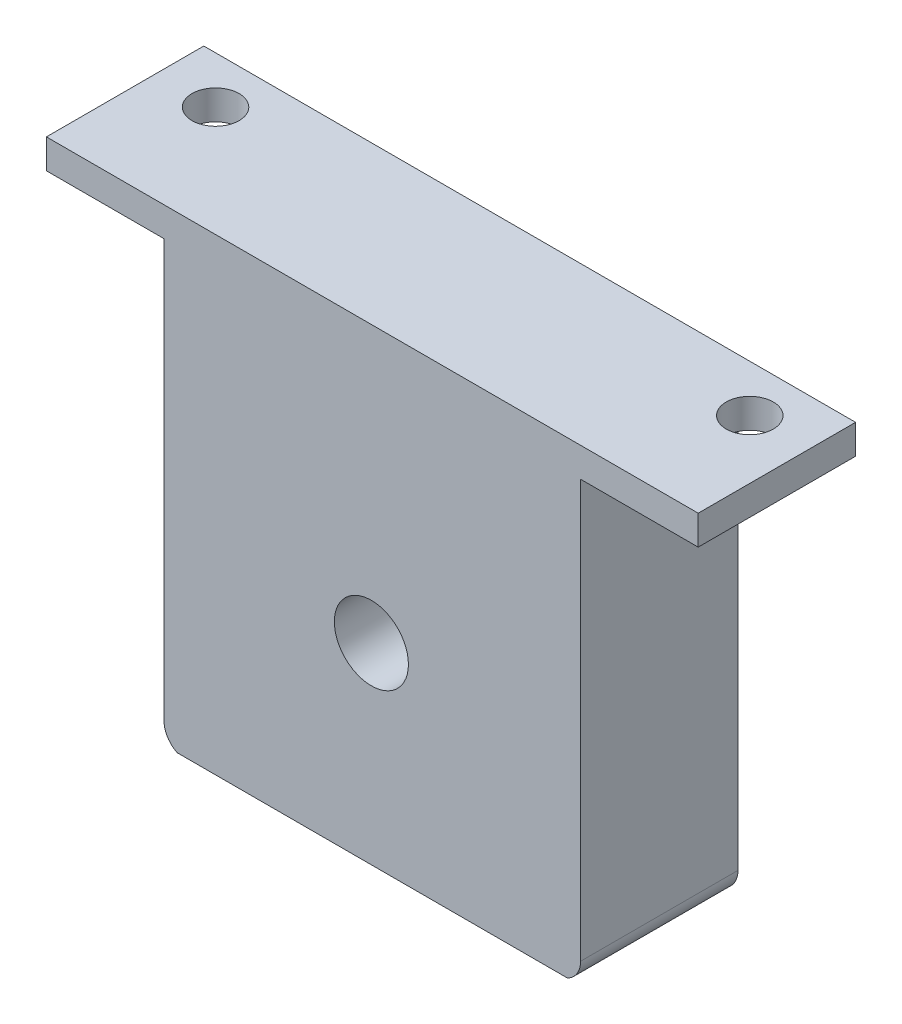
ISO-10303-21;
HEADER;
FILE_DESCRIPTION(('STEP AP214'),'2;1');
FILE_NAME('part.step','',(''),(''),'','','');
FILE_SCHEMA(('AUTOMOTIVE_DESIGN { 1 0 10303 214 1 1 1 1 }'));
ENDSEC;
DATA;
#1=APPLICATION_CONTEXT('core data for automotive mechanical design processes');
#2=APPLICATION_PROTOCOL_DEFINITION('international standard','automotive_design',2000,#1);
#3=PRODUCT_CONTEXT('',#1,'mechanical');
#4=PRODUCT('Part','Part','',(#3));
#5=PRODUCT_RELATED_PRODUCT_CATEGORY('part','',(#4));
#6=PRODUCT_DEFINITION_FORMATION('','',#4);
#7=PRODUCT_DEFINITION_CONTEXT('part definition',#1,'design');
#8=PRODUCT_DEFINITION('design','',#6,#7);
#9=PRODUCT_DEFINITION_SHAPE('','',#8);
#10=(LENGTH_UNIT() NAMED_UNIT(*) SI_UNIT(.MILLI.,.METRE.));
#11=(NAMED_UNIT(*) PLANE_ANGLE_UNIT() SI_UNIT($,.RADIAN.));
#12=(NAMED_UNIT(*) SI_UNIT($,.STERADIAN.) SOLID_ANGLE_UNIT());
#13=UNCERTAINTY_MEASURE_WITH_UNIT(LENGTH_MEASURE(1.E-05),#10,'distance_accuracy_value','');
#14=(GEOMETRIC_REPRESENTATION_CONTEXT(3) GLOBAL_UNCERTAINTY_ASSIGNED_CONTEXT((#13)) GLOBAL_UNIT_ASSIGNED_CONTEXT((#10,
#11,#12)) REPRESENTATION_CONTEXT('',''));
#15=CARTESIAN_POINT('',(0.,0.,0.));
#16=DIRECTION('',(0.,0.,1.));
#17=DIRECTION('',(1.,0.,0.));
#18=AXIS2_PLACEMENT_3D('',#15,#16,#17);
#19=CARTESIAN_POINT('',(45.,0.,17.));
#20=DIRECTION('',(-1.,0.,0.));
#21=DIRECTION('',(0.,0.,1.));
#22=AXIS2_PLACEMENT_3D('',#19,#20,#21);
#23=PLANE('',#22);
#24=DIRECTION('',(0.,0.,1.));
#25=VECTOR('',#24,1.);
#26=CARTESIAN_POINT('',(45.,47.625,0.));
#27=LINE('',#26,#25);
#28=CARTESIAN_POINT('',(45.,47.625,0.));
#29=VERTEX_POINT('',#28);
#30=CARTESIAN_POINT('',(45.,47.625,17.));
#31=VERTEX_POINT('',#30);
#32=EDGE_CURVE('E165',#29,#31,#27,.T.);
#33=ORIENTED_EDGE('',*,*,#32,.T.);
#34=DIRECTION('',(0.,1.,0.));
#35=VECTOR('',#34,1.);
#36=CARTESIAN_POINT('',(45.,0.,17.));
#37=LINE('',#36,#35);
#38=CARTESIAN_POINT('',(45.,2.54,17.));
#39=VERTEX_POINT('',#38);
#40=EDGE_CURVE('E212',#39,#31,#37,.T.);
#41=ORIENTED_EDGE('',*,*,#40,.F.);
#42=DIRECTION('',(0.,0.,-1.));
#43=VECTOR('',#42,1.);
#44=CARTESIAN_POINT('',(45.,2.54,17.));
#45=LINE('',#44,#43);
#46=CARTESIAN_POINT('',(45.,2.54,0.));
#47=VERTEX_POINT('',#46);
#48=EDGE_CURVE('E50',#39,#47,#45,.T.);
#49=ORIENTED_EDGE('',*,*,#48,.T.);
#50=DIRECTION('',(0.,1.,0.));
#51=VECTOR('',#50,1.);
#52=CARTESIAN_POINT('',(45.,0.,0.));
#53=LINE('',#52,#51);
#54=EDGE_CURVE('E223',#47,#29,#53,.T.);
#55=ORIENTED_EDGE('',*,*,#54,.T.);
#56=EDGE_LOOP('',(#33,#41,#49,#55));
#57=FACE_BOUND('',#56,.T.);
#58=ADVANCED_FACE('F41',(#57),#23,.F.);
#59=CARTESIAN_POINT('',(0.,0.,17.));
#60=DIRECTION('',(0.,0.,-1.));
#61=DIRECTION('',(-1.,0.,0.));
#62=AXIS2_PLACEMENT_3D('',#59,#60,#61);
#63=PLANE('',#62);
#64=CARTESIAN_POINT('',(2.54,2.54,17.));
#65=DIRECTION('',(0.,0.,-1.));
#66=DIRECTION('',(-1.,0.,0.));
#67=AXIS2_PLACEMENT_3D('',#64,#65,#66);
#68=CIRCLE('',#67,2.54);
#69=CARTESIAN_POINT('',(0.,2.54,17.));
#70=VERTEX_POINT('',#69);
#71=CARTESIAN_POINT('',(1.43283966834067,0.253999999999998,17.));
#72=VERTEX_POINT('',#71);
#73=EDGE_CURVE('E241',#70,#72,#68,.F.);
#74=ORIENTED_EDGE('',*,*,#73,.T.);
#75=DIRECTION('',(1.,0.,0.));
#76=VECTOR('',#75,1.);
#77=CARTESIAN_POINT('',(0.,0.253999999999998,17.));
#78=LINE('',#77,#76);
#79=CARTESIAN_POINT('',(43.5671603316593,0.253999999999998,17.));
#80=VERTEX_POINT('',#79);
#81=EDGE_CURVE('E193',#72,#80,#78,.T.);
#82=ORIENTED_EDGE('',*,*,#81,.T.);
#83=CARTESIAN_POINT('',(42.46,2.54,17.));
#84=DIRECTION('',(0.,0.,-1.));
#85=DIRECTION('',(-1.,0.,0.));
#86=AXIS2_PLACEMENT_3D('',#83,#84,#85);
#87=CIRCLE('',#86,2.54);
#88=EDGE_CURVE('E238',#80,#39,#87,.F.);
#89=ORIENTED_EDGE('',*,*,#88,.T.);
#90=ORIENTED_EDGE('',*,*,#40,.T.);
#91=DIRECTION('',(1.,0.,0.));
#92=VECTOR('',#91,1.);
#93=CARTESIAN_POINT('',(45.,47.625,17.));
#94=LINE('',#93,#92);
#95=CARTESIAN_POINT('',(57.7,47.625,17.));
#96=VERTEX_POINT('',#95);
#97=EDGE_CURVE('E169',#31,#96,#94,.T.);
#98=ORIENTED_EDGE('',*,*,#97,.T.);
#99=DIRECTION('',(0.,1.,0.));
#100=VECTOR('',#99,1.);
#101=CARTESIAN_POINT('',(57.7,47.625,17.));
#102=LINE('',#101,#100);
#103=CARTESIAN_POINT('',(57.7,50.8,17.));
#104=VERTEX_POINT('',#103);
#105=EDGE_CURVE('E181',#96,#104,#102,.T.);
#106=ORIENTED_EDGE('',*,*,#105,.T.);
#107=DIRECTION('',(-1.,0.,0.));
#108=VECTOR('',#107,1.);
#109=CARTESIAN_POINT('',(0.,50.8,17.));
#110=LINE('',#109,#108);
#111=CARTESIAN_POINT('',(-12.7,50.8,17.));
#112=VERTEX_POINT('',#111);
#113=EDGE_CURVE('E217',#104,#112,#110,.T.);
#114=ORIENTED_EDGE('',*,*,#113,.T.);
#115=DIRECTION('',(0.,1.,0.));
#116=VECTOR('',#115,1.);
#117=CARTESIAN_POINT('',(-12.7,47.625,17.));
#118=LINE('',#117,#116);
#119=CARTESIAN_POINT('',(-12.7,47.625,17.));
#120=VERTEX_POINT('',#119);
#121=EDGE_CURVE('E128',#120,#112,#118,.T.);
#122=ORIENTED_EDGE('',*,*,#121,.F.);
#123=DIRECTION('',(1.,0.,0.));
#124=VECTOR('',#123,1.);
#125=CARTESIAN_POINT('',(0.,47.625,17.));
#126=LINE('',#125,#124);
#127=CARTESIAN_POINT('',(0.,47.625,17.));
#128=VERTEX_POINT('',#127);
#129=EDGE_CURVE('E129',#120,#128,#126,.T.);
#130=ORIENTED_EDGE('',*,*,#129,.T.);
#131=DIRECTION('',(0.,-1.,0.));
#132=VECTOR('',#131,1.);
#133=CARTESIAN_POINT('',(0.,0.,17.));
#134=LINE('',#133,#132);
#135=EDGE_CURVE('E57',#128,#70,#134,.T.);
#136=ORIENTED_EDGE('',*,*,#135,.T.);
#137=EDGE_LOOP('',(#74,#82,#89,#90,#98,#106,#114,#122,#130,#136));
#138=FACE_BOUND('',#137,.T.);
#139=CARTESIAN_POINT('',(22.4,21.,17.));
#140=DIRECTION('',(0.,0.,1.));
#141=DIRECTION('',(1.,0.,0.));
#142=AXIS2_PLACEMENT_3D('',#139,#140,#141);
#143=CIRCLE('',#142,4.);
#144=CARTESIAN_POINT('',(26.4,21.,17.));
#145=VERTEX_POINT('',#144);
#146=EDGE_CURVE('E203',#145,#145,#143,.T.);
#147=ORIENTED_EDGE('',*,*,#146,.F.);
#148=EDGE_LOOP('',(#147));
#149=FACE_BOUND('',#148,.T.);
#150=ADVANCED_FACE('F257',(#138,#149),#63,.F.);
#151=CARTESIAN_POINT('',(0.,0.,0.));
#152=DIRECTION('',(0.,0.,-1.));
#153=DIRECTION('',(-1.,0.,0.));
#154=AXIS2_PLACEMENT_3D('',#151,#152,#153);
#155=PLANE('',#154);
#156=DIRECTION('',(1.,0.,0.));
#157=VECTOR('',#156,1.);
#158=CARTESIAN_POINT('',(0.,0.254,0.));
#159=LINE('',#158,#157);
#160=CARTESIAN_POINT('',(1.43283966834067,0.254,0.));
#161=VERTEX_POINT('',#160);
#162=CARTESIAN_POINT('',(43.5671603316593,0.253999999999999,0.));
#163=VERTEX_POINT('',#162);
#164=EDGE_CURVE('E189',#161,#163,#159,.T.);
#165=ORIENTED_EDGE('',*,*,#164,.F.);
#166=CARTESIAN_POINT('',(2.54,2.54,0.));
#167=DIRECTION('',(0.,0.,-1.));
#168=DIRECTION('',(-1.,0.,0.));
#169=AXIS2_PLACEMENT_3D('',#166,#167,#168);
#170=CIRCLE('',#169,2.54);
#171=CARTESIAN_POINT('',(0.,2.54,0.));
#172=VERTEX_POINT('',#171);
#173=EDGE_CURVE('E232',#161,#172,#170,.T.);
#174=ORIENTED_EDGE('',*,*,#173,.T.);
#175=DIRECTION('',(0.,-1.,0.));
#176=VECTOR('',#175,1.);
#177=CARTESIAN_POINT('',(0.,0.,0.));
#178=LINE('',#177,#176);
#179=CARTESIAN_POINT('',(0.,47.625,0.));
#180=VERTEX_POINT('',#179);
#181=EDGE_CURVE('E142',#180,#172,#178,.T.);
#182=ORIENTED_EDGE('',*,*,#181,.F.);
#183=DIRECTION('',(-1.,0.,0.));
#184=VECTOR('',#183,1.);
#185=CARTESIAN_POINT('',(0.,47.625,0.));
#186=LINE('',#185,#184);
#187=CARTESIAN_POINT('',(-12.7,47.625,0.));
#188=VERTEX_POINT('',#187);
#189=EDGE_CURVE('E134',#180,#188,#186,.T.);
#190=ORIENTED_EDGE('',*,*,#189,.T.);
#191=DIRECTION('',(0.,1.,0.));
#192=VECTOR('',#191,1.);
#193=CARTESIAN_POINT('',(-12.7,47.625,0.));
#194=LINE('',#193,#192);
#195=CARTESIAN_POINT('',(-12.7,50.8,0.));
#196=VERTEX_POINT('',#195);
#197=EDGE_CURVE('E117',#188,#196,#194,.T.);
#198=ORIENTED_EDGE('',*,*,#197,.T.);
#199=DIRECTION('',(-1.,0.,0.));
#200=VECTOR('',#199,1.);
#201=CARTESIAN_POINT('',(0.,50.8,0.));
#202=LINE('',#201,#200);
#203=CARTESIAN_POINT('',(57.7,50.8,0.));
#204=VERTEX_POINT('',#203);
#205=EDGE_CURVE('E213',#204,#196,#202,.T.);
#206=ORIENTED_EDGE('',*,*,#205,.F.);
#207=DIRECTION('',(0.,1.,0.));
#208=VECTOR('',#207,1.);
#209=CARTESIAN_POINT('',(57.7,47.625,0.));
#210=LINE('',#209,#208);
#211=CARTESIAN_POINT('',(57.7,47.625,0.));
#212=VERTEX_POINT('',#211);
#213=EDGE_CURVE('E185',#212,#204,#210,.T.);
#214=ORIENTED_EDGE('',*,*,#213,.F.);
#215=DIRECTION('',(-1.,0.,0.));
#216=VECTOR('',#215,1.);
#217=CARTESIAN_POINT('',(45.,47.625,0.));
#218=LINE('',#217,#216);
#219=EDGE_CURVE('E177',#212,#29,#218,.T.);
#220=ORIENTED_EDGE('',*,*,#219,.T.);
#221=ORIENTED_EDGE('',*,*,#54,.F.);
#222=CARTESIAN_POINT('',(42.46,2.54,0.));
#223=DIRECTION('',(0.,0.,-1.));
#224=DIRECTION('',(-1.,0.,0.));
#225=AXIS2_PLACEMENT_3D('',#222,#223,#224);
#226=CIRCLE('',#225,2.54);
#227=EDGE_CURVE('E220',#47,#163,#226,.T.);
#228=ORIENTED_EDGE('',*,*,#227,.T.);
#229=EDGE_LOOP('',(#165,#174,#182,#190,#198,#206,#214,#220,#221,#228));
#230=FACE_BOUND('',#229,.T.);
#231=CARTESIAN_POINT('',(22.4,21.,0.));
#232=DIRECTION('',(0.,0.,1.));
#233=DIRECTION('',(1.,0.,0.));
#234=AXIS2_PLACEMENT_3D('',#231,#232,#233);
#235=CIRCLE('',#234,4.);
#236=CARTESIAN_POINT('',(26.4,21.,0.));
#237=VERTEX_POINT('',#236);
#238=EDGE_CURVE('E202',#237,#237,#235,.T.);
#239=ORIENTED_EDGE('',*,*,#238,.T.);
#240=EDGE_LOOP('',(#239));
#241=FACE_BOUND('',#240,.T.);
#242=ADVANCED_FACE('F139',(#230,#241),#155,.T.);
#243=CARTESIAN_POINT('',(0.,0.,17.));
#244=DIRECTION('',(1.,0.,0.));
#245=DIRECTION('',(0.,0.,-1.));
#246=AXIS2_PLACEMENT_3D('',#243,#244,#245);
#247=PLANE('',#246);
#248=ORIENTED_EDGE('',*,*,#135,.F.);
#249=DIRECTION('',(0.,0.,-1.));
#250=VECTOR('',#249,1.);
#251=CARTESIAN_POINT('',(0.,47.625,0.));
#252=LINE('',#251,#250);
#253=EDGE_CURVE('E61',#128,#180,#252,.T.);
#254=ORIENTED_EDGE('',*,*,#253,.T.);
#255=ORIENTED_EDGE('',*,*,#181,.T.);
#256=DIRECTION('',(0.,0.,-1.));
#257=VECTOR('',#256,1.);
#258=CARTESIAN_POINT('',(0.,2.54,17.));
#259=LINE('',#258,#257);
#260=EDGE_CURVE('E235',#172,#70,#259,.F.);
#261=ORIENTED_EDGE('',*,*,#260,.T.);
#262=EDGE_LOOP('',(#248,#254,#255,#261));
#263=FACE_BOUND('',#262,.T.);
#264=ADVANCED_FACE('F268',(#263),#247,.F.);
#265=CARTESIAN_POINT('',(0.,50.8,17.));
#266=DIRECTION('',(0.,-1.,0.));
#267=DIRECTION('',(0.,0.,-1.));
#268=AXIS2_PLACEMENT_3D('',#265,#266,#267);
#269=PLANE('',#268);
#270=ORIENTED_EDGE('',*,*,#205,.T.);
#271=DIRECTION('',(0.,0.,1.));
#272=VECTOR('',#271,1.);
#273=CARTESIAN_POINT('',(-12.7,50.8,0.));
#274=LINE('',#273,#272);
#275=EDGE_CURVE('E124',#196,#112,#274,.T.);
#276=ORIENTED_EDGE('',*,*,#275,.T.);
#277=ORIENTED_EDGE('',*,*,#113,.F.);
#278=DIRECTION('',(0.,0.,-1.));
#279=VECTOR('',#278,1.);
#280=CARTESIAN_POINT('',(57.7,50.8,0.));
#281=LINE('',#280,#279);
#282=EDGE_CURVE('E161',#104,#204,#281,.T.);
#283=ORIENTED_EDGE('',*,*,#282,.T.);
#284=EDGE_LOOP('',(#270,#276,#277,#283));
#285=FACE_BOUND('',#284,.T.);
#286=CARTESIAN_POINT('',(51.35,50.8,5.08));
#287=DIRECTION('',(0.,1.,0.));
#288=DIRECTION('',(0.,0.,1.));
#289=AXIS2_PLACEMENT_3D('',#286,#287,#288);
#290=CIRCLE('',#289,2.54);
#291=CARTESIAN_POINT('',(51.35,50.8,7.62));
#292=VERTEX_POINT('',#291);
#293=EDGE_CURVE('E155',#292,#292,#290,.T.);
#294=ORIENTED_EDGE('',*,*,#293,.F.);
#295=EDGE_LOOP('',(#294));
#296=FACE_BOUND('',#295,.T.);
#297=CARTESIAN_POINT('',(-6.35,50.8,5.08));
#298=DIRECTION('',(0.,1.,0.));
#299=DIRECTION('',(0.,0.,1.));
#300=AXIS2_PLACEMENT_3D('',#297,#298,#299);
#301=CIRCLE('',#300,2.54);
#302=CARTESIAN_POINT('',(-6.35,50.8,7.62));
#303=VERTEX_POINT('',#302);
#304=EDGE_CURVE('E318',#303,#303,#301,.T.);
#305=ORIENTED_EDGE('',*,*,#304,.F.);
#306=EDGE_LOOP('',(#305));
#307=FACE_BOUND('',#306,.T.);
#308=ADVANCED_FACE('F270',(#285,#296,#307),#269,.F.);
#309=CARTESIAN_POINT('',(22.4,21.,17.));
#310=DIRECTION('',(0.,0.,-1.));
#311=DIRECTION('',(-1.,0.,0.));
#312=AXIS2_PLACEMENT_3D('',#309,#310,#311);
#313=CYLINDRICAL_SURFACE('',#312,4.);
#314=ORIENTED_EDGE('',*,*,#146,.T.);
#315=EDGE_LOOP('',(#314));
#316=FACE_BOUND('',#315,.T.);
#317=ORIENTED_EDGE('',*,*,#238,.F.);
#318=EDGE_LOOP('',(#317));
#319=FACE_BOUND('',#318,.T.);
#320=ADVANCED_FACE('F276',(#316,#319),#313,.F.);
#321=CARTESIAN_POINT('',(2.54,2.54,17.));
#322=DIRECTION('',(0.,0.,-1.));
#323=DIRECTION('',(-1.,0.,0.));
#324=AXIS2_PLACEMENT_3D('',#321,#322,#323);
#325=CYLINDRICAL_SURFACE('',#324,2.54);
#326=DIRECTION('',(0.,0.,-1.));
#327=VECTOR('',#326,1.);
#328=CARTESIAN_POINT('',(1.43283966834067,0.253999999999999,17.));
#329=LINE('',#328,#327);
#330=EDGE_CURVE('E197',#72,#161,#329,.T.);
#331=ORIENTED_EDGE('',*,*,#330,.F.);
#332=ORIENTED_EDGE('',*,*,#73,.F.);
#333=ORIENTED_EDGE('',*,*,#260,.F.);
#334=ORIENTED_EDGE('',*,*,#173,.F.);
#335=EDGE_LOOP('',(#331,#332,#333,#334));
#336=FACE_BOUND('',#335,.T.);
#337=ADVANCED_FACE('F266',(#336),#325,.T.);
#338=CARTESIAN_POINT('',(42.46,2.54,17.));
#339=DIRECTION('',(0.,0.,-1.));
#340=DIRECTION('',(-1.,0.,0.));
#341=AXIS2_PLACEMENT_3D('',#338,#339,#340);
#342=CYLINDRICAL_SURFACE('',#341,2.54);
#343=DIRECTION('',(0.,0.,-1.));
#344=VECTOR('',#343,1.);
#345=CARTESIAN_POINT('',(43.5671603316593,0.253999999999999,17.));
#346=LINE('',#345,#344);
#347=EDGE_CURVE('E11',#163,#80,#346,.F.);
#348=ORIENTED_EDGE('',*,*,#347,.F.);
#349=ORIENTED_EDGE('',*,*,#227,.F.);
#350=ORIENTED_EDGE('',*,*,#48,.F.);
#351=ORIENTED_EDGE('',*,*,#88,.F.);
#352=EDGE_LOOP('',(#348,#349,#350,#351));
#353=FACE_BOUND('',#352,.T.);
#354=ADVANCED_FACE('F43',(#353),#342,.T.);
#355=CARTESIAN_POINT('',(0.,0.254,0.));
#356=DIRECTION('',(0.,1.,0.));
#357=DIRECTION('',(0.,0.,1.));
#358=AXIS2_PLACEMENT_3D('',#355,#356,#357);
#359=PLANE('',#358);
#360=ORIENTED_EDGE('',*,*,#330,.T.);
#361=ORIENTED_EDGE('',*,*,#164,.T.);
#362=ORIENTED_EDGE('',*,*,#347,.T.);
#363=ORIENTED_EDGE('',*,*,#81,.F.);
#364=EDGE_LOOP('',(#360,#361,#362,#363));
#365=FACE_BOUND('',#364,.T.);
#366=ADVANCED_FACE('F261',(#365),#359,.F.);
#367=CARTESIAN_POINT('',(57.7,47.625,0.));
#368=DIRECTION('',(1.,0.,0.));
#369=DIRECTION('',(0.,0.,-1.));
#370=AXIS2_PLACEMENT_3D('',#367,#368,#369);
#371=PLANE('',#370);
#372=ORIENTED_EDGE('',*,*,#282,.F.);
#373=ORIENTED_EDGE('',*,*,#105,.F.);
#374=DIRECTION('',(0.,0.,-1.));
#375=VECTOR('',#374,1.);
#376=CARTESIAN_POINT('',(57.7,47.625,0.));
#377=LINE('',#376,#375);
#378=EDGE_CURVE('E173',#96,#212,#377,.T.);
#379=ORIENTED_EDGE('',*,*,#378,.T.);
#380=ORIENTED_EDGE('',*,*,#213,.T.);
#381=EDGE_LOOP('',(#372,#373,#379,#380));
#382=FACE_BOUND('',#381,.T.);
#383=ADVANCED_FACE('F292',(#382),#371,.T.);
#384=CARTESIAN_POINT('',(0.,47.625,0.));
#385=DIRECTION('',(0.,1.,0.));
#386=DIRECTION('',(0.,0.,1.));
#387=AXIS2_PLACEMENT_3D('',#384,#385,#386);
#388=PLANE('',#387);
#389=CARTESIAN_POINT('',(51.35,47.625,5.08));
#390=DIRECTION('',(0.,1.,0.));
#391=DIRECTION('',(0.,0.,1.));
#392=AXIS2_PLACEMENT_3D('',#389,#390,#391);
#393=CIRCLE('',#392,2.54);
#394=CARTESIAN_POINT('',(51.35,47.625,7.62));
#395=VERTEX_POINT('',#394);
#396=EDGE_CURVE('E157',#395,#395,#393,.T.);
#397=ORIENTED_EDGE('',*,*,#396,.T.);
#398=EDGE_LOOP('',(#397));
#399=FACE_BOUND('',#398,.T.);
#400=ORIENTED_EDGE('',*,*,#32,.F.);
#401=ORIENTED_EDGE('',*,*,#219,.F.);
#402=ORIENTED_EDGE('',*,*,#378,.F.);
#403=ORIENTED_EDGE('',*,*,#97,.F.);
#404=EDGE_LOOP('',(#400,#401,#402,#403));
#405=FACE_BOUND('',#404,.T.);
#406=ADVANCED_FACE('F255',(#399,#405),#388,.F.);
#407=CARTESIAN_POINT('',(51.35,47.625,5.08));
#408=DIRECTION('',(0.,1.,0.));
#409=DIRECTION('',(0.,0.,1.));
#410=AXIS2_PLACEMENT_3D('',#407,#408,#409);
#411=CYLINDRICAL_SURFACE('',#410,2.54);
#412=ORIENTED_EDGE('',*,*,#396,.F.);
#413=EDGE_LOOP('',(#412));
#414=FACE_BOUND('',#413,.T.);
#415=ORIENTED_EDGE('',*,*,#293,.T.);
#416=EDGE_LOOP('',(#415));
#417=FACE_BOUND('',#416,.T.);
#418=ADVANCED_FACE('F298',(#414,#417),#411,.F.);
#419=CARTESIAN_POINT('',(-12.7,47.625,0.));
#420=DIRECTION('',(-1.,0.,0.));
#421=DIRECTION('',(0.,0.,1.));
#422=AXIS2_PLACEMENT_3D('',#419,#420,#421);
#423=PLANE('',#422);
#424=ORIENTED_EDGE('',*,*,#275,.F.);
#425=ORIENTED_EDGE('',*,*,#197,.F.);
#426=DIRECTION('',(0.,0.,1.));
#427=VECTOR('',#426,1.);
#428=CARTESIAN_POINT('',(-12.7,47.625,0.));
#429=LINE('',#428,#427);
#430=EDGE_CURVE('E121',#188,#120,#429,.T.);
#431=ORIENTED_EDGE('',*,*,#430,.T.);
#432=ORIENTED_EDGE('',*,*,#121,.T.);
#433=EDGE_LOOP('',(#424,#425,#431,#432));
#434=FACE_BOUND('',#433,.T.);
#435=ADVANCED_FACE('F119',(#434),#423,.T.);
#436=CARTESIAN_POINT('',(0.,47.625,0.));
#437=DIRECTION('',(0.,-1.,0.));
#438=DIRECTION('',(0.,0.,-1.));
#439=AXIS2_PLACEMENT_3D('',#436,#437,#438);
#440=PLANE('',#439);
#441=CARTESIAN_POINT('',(-6.35,47.625,5.08));
#442=DIRECTION('',(0.,1.,0.));
#443=DIRECTION('',(0.,0.,1.));
#444=AXIS2_PLACEMENT_3D('',#441,#442,#443);
#445=CIRCLE('',#444,2.54);
#446=CARTESIAN_POINT('',(-6.35,47.625,7.62));
#447=VERTEX_POINT('',#446);
#448=EDGE_CURVE('E153',#447,#447,#445,.T.);
#449=ORIENTED_EDGE('',*,*,#448,.T.);
#450=EDGE_LOOP('',(#449));
#451=FACE_BOUND('',#450,.T.);
#452=ORIENTED_EDGE('',*,*,#253,.F.);
#453=ORIENTED_EDGE('',*,*,#129,.F.);
#454=ORIENTED_EDGE('',*,*,#430,.F.);
#455=ORIENTED_EDGE('',*,*,#189,.F.);
#456=EDGE_LOOP('',(#452,#453,#454,#455));
#457=FACE_BOUND('',#456,.T.);
#458=ADVANCED_FACE('F133',(#451,#457),#440,.T.);
#459=CARTESIAN_POINT('',(-6.35,47.625,5.08));
#460=DIRECTION('',(0.,1.,0.));
#461=DIRECTION('',(0.,0.,1.));
#462=AXIS2_PLACEMENT_3D('',#459,#460,#461);
#463=CYLINDRICAL_SURFACE('',#462,2.54);
#464=ORIENTED_EDGE('',*,*,#448,.F.);
#465=EDGE_LOOP('',(#464));
#466=FACE_BOUND('',#465,.T.);
#467=ORIENTED_EDGE('',*,*,#304,.T.);
#468=EDGE_LOOP('',(#467));
#469=FACE_BOUND('',#468,.T.);
#470=ADVANCED_FACE('F307',(#466,#469),#463,.F.);
#471=CLOSED_SHELL('',(#58,#150,#242,#264,#308,#320,#337,#354,#366,#383,#406,#418,#435,#458,#470));
#472=MANIFOLD_SOLID_BREP('B2',#471);
#473=ADVANCED_BREP_SHAPE_REPRESENTATION('',(#18,#472),#14);
#474=SHAPE_DEFINITION_REPRESENTATION(#9,#473);
ENDSEC;
END-ISO-10303-21;
